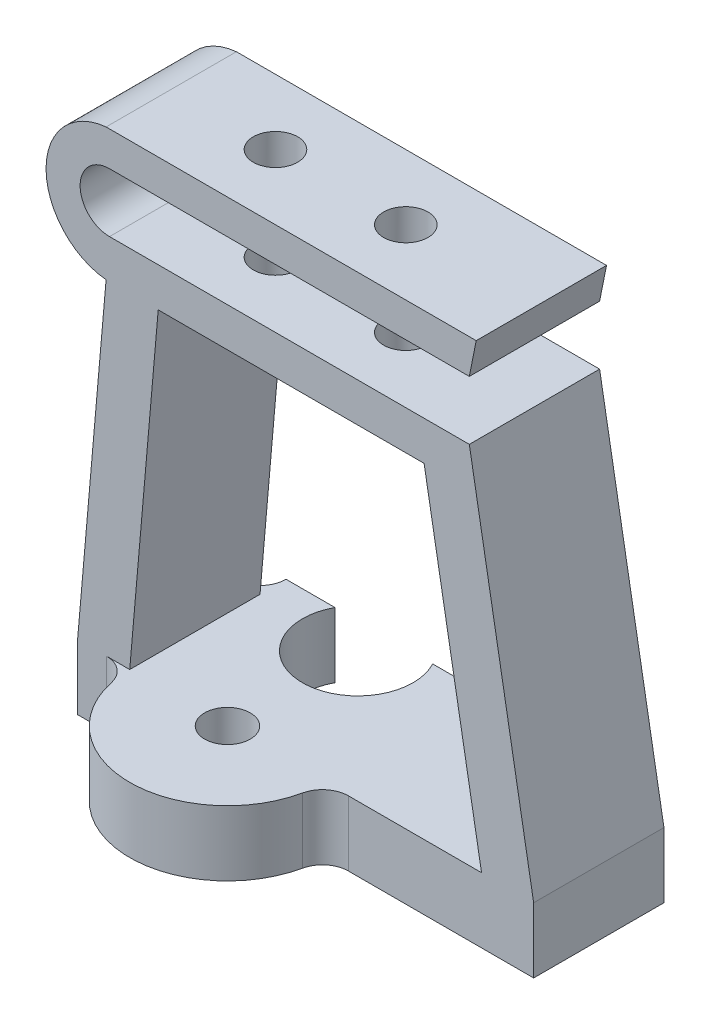
ISO-10303-21;
HEADER;
FILE_DESCRIPTION(('STEP AP214'),'2;1');
FILE_NAME('part.step','',(''),(''),'','','');
FILE_SCHEMA(('AUTOMOTIVE_DESIGN { 1 0 10303 214 1 1 1 1 }'));
ENDSEC;
DATA;
#1=APPLICATION_CONTEXT('core data for automotive mechanical design processes');
#2=APPLICATION_PROTOCOL_DEFINITION('international standard','automotive_design',2000,#1);
#3=PRODUCT_CONTEXT('',#1,'mechanical');
#4=PRODUCT('Part','Part','',(#3));
#5=PRODUCT_RELATED_PRODUCT_CATEGORY('part','',(#4));
#6=PRODUCT_DEFINITION_FORMATION('','',#4);
#7=PRODUCT_DEFINITION_CONTEXT('part definition',#1,'design');
#8=PRODUCT_DEFINITION('design','',#6,#7);
#9=PRODUCT_DEFINITION_SHAPE('','',#8);
#10=(LENGTH_UNIT() NAMED_UNIT(*) SI_UNIT(.MILLI.,.METRE.));
#11=(NAMED_UNIT(*) PLANE_ANGLE_UNIT() SI_UNIT($,.RADIAN.));
#12=(NAMED_UNIT(*) SI_UNIT($,.STERADIAN.) SOLID_ANGLE_UNIT());
#13=UNCERTAINTY_MEASURE_WITH_UNIT(LENGTH_MEASURE(1.E-05),#10,'distance_accuracy_value','');
#14=(GEOMETRIC_REPRESENTATION_CONTEXT(3) GLOBAL_UNCERTAINTY_ASSIGNED_CONTEXT((#13)) GLOBAL_UNIT_ASSIGNED_CONTEXT((#10,
#11,#12)) REPRESENTATION_CONTEXT('',''));
#15=CARTESIAN_POINT('',(0.,0.,0.));
#16=DIRECTION('',(0.,0.,1.));
#17=DIRECTION('',(1.,0.,0.));
#18=AXIS2_PLACEMENT_3D('',#15,#16,#17);
#19=CARTESIAN_POINT('',(0.,5.,10.));
#20=DIRECTION('',(0.,1.,0.));
#21=DIRECTION('',(0.,0.,1.));
#22=AXIS2_PLACEMENT_3D('',#19,#20,#21);
#23=PLANE('',#22);
#24=DIRECTION('',(1.,0.,0.));
#25=VECTOR('',#24,1.);
#26=CARTESIAN_POINT('',(-11.6253284417662,5.,-2.));
#27=LINE('',#26,#25);
#28=CARTESIAN_POINT('',(-7.5,5.,-2.));
#29=VERTEX_POINT('',#28);
#30=CARTESIAN_POINT('',(-3.75,5.,-2.));
#31=VERTEX_POINT('',#30);
#32=EDGE_CURVE('E216',#29,#31,#27,.T.);
#33=ORIENTED_EDGE('',*,*,#32,.F.);
#34=CARTESIAN_POINT('',(-9.5,5.,-2.));
#35=DIRECTION('',(0.,1.,0.));
#36=DIRECTION('',(0.,0.,1.));
#37=AXIS2_PLACEMENT_3D('',#34,#35,#36);
#38=CIRCLE('',#37,2.);
#39=CARTESIAN_POINT('',(-9.5,5.,0.));
#40=VERTEX_POINT('',#39);
#41=EDGE_CURVE('E230',#29,#40,#38,.F.);
#42=ORIENTED_EDGE('',*,*,#41,.T.);
#43=DIRECTION('',(-1.,0.,0.));
#44=VECTOR('',#43,1.);
#45=CARTESIAN_POINT('',(23.5,5.,0.));
#46=LINE('',#45,#44);
#47=CARTESIAN_POINT('',(-7.5,5.,0.));
#48=VERTEX_POINT('',#47);
#49=EDGE_CURVE('E62',#48,#40,#46,.T.);
#50=ORIENTED_EDGE('',*,*,#49,.F.);
#51=DIRECTION('',(0.,0.,1.));
#52=VECTOR('',#51,1.);
#53=CARTESIAN_POINT('',(-7.5,5.,-26.3760762570989));
#54=LINE('',#53,#52);
#55=CARTESIAN_POINT('',(-7.5,5.,10.));
#56=VERTEX_POINT('',#55);
#57=EDGE_CURVE('E405',#48,#56,#54,.T.);
#58=ORIENTED_EDGE('',*,*,#57,.T.);
#59=DIRECTION('',(1.,0.,0.));
#60=VECTOR('',#59,1.);
#61=CARTESIAN_POINT('',(23.5,5.,10.));
#62=LINE('',#61,#60);
#63=CARTESIAN_POINT('',(-9.28708781050335,5.,10.));
#64=VERTEX_POINT('',#63);
#65=EDGE_CURVE('E514',#64,#56,#62,.T.);
#66=ORIENTED_EDGE('',*,*,#65,.F.);
#67=CARTESIAN_POINT('',(-9.28708781050335,5.,12.));
#68=DIRECTION('',(0.,1.,0.));
#69=DIRECTION('',(0.,0.,1.));
#70=AXIS2_PLACEMENT_3D('',#67,#68,#69);
#71=CIRCLE('',#70,2.);
#72=CARTESIAN_POINT('',(-7.33191142934475,5.,11.5789473684211));
#73=VERTEX_POINT('',#72);
#74=EDGE_CURVE('E253',#64,#73,#71,.F.);
#75=ORIENTED_EDGE('',*,*,#74,.T.);
#76=CARTESIAN_POINT('',(0.,5.,10.));
#77=DIRECTION('',(0.,1.,0.));
#78=DIRECTION('',(0.,0.,1.));
#79=AXIS2_PLACEMENT_3D('',#76,#77,#78);
#80=CIRCLE('',#79,7.5);
#81=CARTESIAN_POINT('',(7.33191142934475,5.,11.5789473684211));
#82=VERTEX_POINT('',#81);
#83=EDGE_CURVE('E226',#73,#82,#80,.T.);
#84=ORIENTED_EDGE('',*,*,#83,.T.);
#85=CARTESIAN_POINT('',(9.28708781050335,5.,12.));
#86=DIRECTION('',(0.,1.,0.));
#87=DIRECTION('',(0.,0.,1.));
#88=AXIS2_PLACEMENT_3D('',#85,#86,#87);
#89=CIRCLE('',#88,2.);
#90=CARTESIAN_POINT('',(9.28708781050335,5.,10.));
#91=VERTEX_POINT('',#90);
#92=EDGE_CURVE('E259',#82,#91,#89,.F.);
#93=ORIENTED_EDGE('',*,*,#92,.T.);
#94=DIRECTION('',(-1.,0.,0.));
#95=VECTOR('',#94,1.);
#96=CARTESIAN_POINT('',(23.5,5.,10.));
#97=LINE('',#96,#95);
#98=CARTESIAN_POINT('',(19.5,5.,10.));
#99=VERTEX_POINT('',#98);
#100=EDGE_CURVE('E459',#99,#91,#97,.T.);
#101=ORIENTED_EDGE('',*,*,#100,.F.);
#102=DIRECTION('',(0.,0.,1.));
#103=VECTOR('',#102,1.);
#104=CARTESIAN_POINT('',(19.5,5.,-26.3760762570989));
#105=LINE('',#104,#103);
#106=CARTESIAN_POINT('',(19.5,5.,0.));
#107=VERTEX_POINT('',#106);
#108=EDGE_CURVE('E383',#107,#99,#105,.T.);
#109=ORIENTED_EDGE('',*,*,#108,.F.);
#110=DIRECTION('',(-1.,0.,0.));
#111=VECTOR('',#110,1.);
#112=CARTESIAN_POINT('',(23.5,5.,0.));
#113=LINE('',#112,#111);
#114=CARTESIAN_POINT('',(9.5,5.,0.));
#115=VERTEX_POINT('',#114);
#116=EDGE_CURVE('E463',#107,#115,#113,.T.);
#117=ORIENTED_EDGE('',*,*,#116,.T.);
#118=CARTESIAN_POINT('',(9.5,5.,-2.));
#119=DIRECTION('',(0.,1.,0.));
#120=DIRECTION('',(0.,0.,1.));
#121=AXIS2_PLACEMENT_3D('',#118,#119,#120);
#122=CIRCLE('',#121,2.);
#123=CARTESIAN_POINT('',(7.5,5.,-2.));
#124=VERTEX_POINT('',#123);
#125=EDGE_CURVE('E54',#115,#124,#122,.F.);
#126=ORIENTED_EDGE('',*,*,#125,.T.);
#127=CARTESIAN_POINT('',(3.75,5.,-2.));
#128=VERTEX_POINT('',#127);
#129=EDGE_CURVE('E70',#128,#124,#27,.T.);
#130=ORIENTED_EDGE('',*,*,#129,.F.);
#131=CARTESIAN_POINT('',(0.,5.,0.));
#132=DIRECTION('',(0.,1.,0.));
#133=DIRECTION('',(0.,0.,1.));
#134=AXIS2_PLACEMENT_3D('',#131,#132,#133);
#135=CIRCLE('',#134,4.25);
#136=EDGE_CURVE('E232',#31,#128,#135,.T.);
#137=ORIENTED_EDGE('',*,*,#136,.F.);
#138=EDGE_LOOP('',(#33,#42,#50,#58,#66,#75,#84,#93,#101,#109,#117,#126,#130,#137));
#139=FACE_BOUND('',#138,.T.);
#140=CARTESIAN_POINT('',(0.,5.,10.));
#141=DIRECTION('',(0.,1.,0.));
#142=DIRECTION('',(0.,0.,-1.));
#143=AXIS2_PLACEMENT_3D('',#140,#141,#142);
#144=CIRCLE('',#143,1.75);
#145=CARTESIAN_POINT('',(0.,5.,8.25));
#146=VERTEX_POINT('',#145);
#147=EDGE_CURVE('E476',#146,#146,#144,.T.);
#148=ORIENTED_EDGE('',*,*,#147,.F.);
#149=EDGE_LOOP('',(#148));
#150=FACE_BOUND('',#149,.T.);
#151=ADVANCED_FACE('F44',(#139,#150),#23,.T.);
#152=CARTESIAN_POINT('',(0.,0.,10.));
#153=DIRECTION('',(0.,1.,0.));
#154=DIRECTION('',(0.,0.,1.));
#155=AXIS2_PLACEMENT_3D('',#152,#153,#154);
#156=PLANE('',#155);
#157=CARTESIAN_POINT('',(-9.5,0.,-2.));
#158=DIRECTION('',(0.,1.,0.));
#159=DIRECTION('',(0.,0.,1.));
#160=AXIS2_PLACEMENT_3D('',#157,#158,#159);
#161=CIRCLE('',#160,2.);
#162=CARTESIAN_POINT('',(-9.5,0.,0.));
#163=VERTEX_POINT('',#162);
#164=CARTESIAN_POINT('',(-7.5,0.,-2.));
#165=VERTEX_POINT('',#164);
#166=EDGE_CURVE('E240',#163,#165,#161,.T.);
#167=ORIENTED_EDGE('',*,*,#166,.T.);
#168=DIRECTION('',(1.,0.,0.));
#169=VECTOR('',#168,1.);
#170=CARTESIAN_POINT('',(-11.6253284417662,0.,-2.));
#171=LINE('',#170,#169);
#172=CARTESIAN_POINT('',(-3.75,0.,-2.));
#173=VERTEX_POINT('',#172);
#174=EDGE_CURVE('E219',#165,#173,#171,.T.);
#175=ORIENTED_EDGE('',*,*,#174,.T.);
#176=CARTESIAN_POINT('',(0.,0.,0.));
#177=DIRECTION('',(0.,1.,0.));
#178=DIRECTION('',(0.,0.,1.));
#179=AXIS2_PLACEMENT_3D('',#176,#177,#178);
#180=CIRCLE('',#179,4.25);
#181=CARTESIAN_POINT('',(3.75,0.,-2.));
#182=VERTEX_POINT('',#181);
#183=EDGE_CURVE('E480',#173,#182,#180,.T.);
#184=ORIENTED_EDGE('',*,*,#183,.T.);
#185=CARTESIAN_POINT('',(7.5,0.,-2.));
#186=VERTEX_POINT('',#185);
#187=EDGE_CURVE('E234',#182,#186,#171,.T.);
#188=ORIENTED_EDGE('',*,*,#187,.T.);
#189=CARTESIAN_POINT('',(9.5,0.,-2.));
#190=DIRECTION('',(0.,1.,0.));
#191=DIRECTION('',(0.,0.,1.));
#192=AXIS2_PLACEMENT_3D('',#189,#190,#191);
#193=CIRCLE('',#192,2.);
#194=CARTESIAN_POINT('',(9.5,0.,0.));
#195=VERTEX_POINT('',#194);
#196=EDGE_CURVE('E11',#186,#195,#193,.T.);
#197=ORIENTED_EDGE('',*,*,#196,.T.);
#198=DIRECTION('',(-1.,0.,0.));
#199=VECTOR('',#198,1.);
#200=CARTESIAN_POINT('',(23.5,0.,0.));
#201=LINE('',#200,#199);
#202=CARTESIAN_POINT('',(23.5,0.,0.));
#203=VERTEX_POINT('',#202);
#204=EDGE_CURVE('E467',#203,#195,#201,.T.);
#205=ORIENTED_EDGE('',*,*,#204,.F.);
#206=DIRECTION('',(0.,0.,-1.));
#207=VECTOR('',#206,1.);
#208=CARTESIAN_POINT('',(23.5,0.,10.));
#209=LINE('',#208,#207);
#210=CARTESIAN_POINT('',(23.5,0.,10.));
#211=VERTEX_POINT('',#210);
#212=EDGE_CURVE('E448',#211,#203,#209,.T.);
#213=ORIENTED_EDGE('',*,*,#212,.F.);
#214=DIRECTION('',(-1.,0.,0.));
#215=VECTOR('',#214,1.);
#216=CARTESIAN_POINT('',(23.5,0.,10.));
#217=LINE('',#216,#215);
#218=CARTESIAN_POINT('',(9.28708781050335,0.,10.));
#219=VERTEX_POINT('',#218);
#220=EDGE_CURVE('E471',#211,#219,#217,.T.);
#221=ORIENTED_EDGE('',*,*,#220,.T.);
#222=CARTESIAN_POINT('',(9.28708781050335,0.,12.));
#223=DIRECTION('',(0.,1.,0.));
#224=DIRECTION('',(0.,0.,1.));
#225=AXIS2_PLACEMENT_3D('',#222,#223,#224);
#226=CIRCLE('',#225,2.);
#227=CARTESIAN_POINT('',(7.33191142934475,0.,11.5789473684211));
#228=VERTEX_POINT('',#227);
#229=EDGE_CURVE('E256',#219,#228,#226,.T.);
#230=ORIENTED_EDGE('',*,*,#229,.T.);
#231=CARTESIAN_POINT('',(0.,0.,10.));
#232=DIRECTION('',(0.,1.,0.));
#233=DIRECTION('',(0.,0.,1.));
#234=AXIS2_PLACEMENT_3D('',#231,#232,#233);
#235=CIRCLE('',#234,7.5);
#236=CARTESIAN_POINT('',(-7.33191142934475,0.,11.5789473684211));
#237=VERTEX_POINT('',#236);
#238=EDGE_CURVE('E486',#237,#228,#235,.T.);
#239=ORIENTED_EDGE('',*,*,#238,.F.);
#240=CARTESIAN_POINT('',(-9.28708781050335,0.,12.));
#241=DIRECTION('',(0.,1.,0.));
#242=DIRECTION('',(0.,0.,1.));
#243=AXIS2_PLACEMENT_3D('',#240,#241,#242);
#244=CIRCLE('',#243,2.);
#245=CARTESIAN_POINT('',(-9.28708781050335,0.,10.));
#246=VERTEX_POINT('',#245);
#247=EDGE_CURVE('E245',#237,#246,#244,.T.);
#248=ORIENTED_EDGE('',*,*,#247,.T.);
#249=DIRECTION('',(1.,0.,0.));
#250=VECTOR('',#249,1.);
#251=CARTESIAN_POINT('',(-11.5,0.,10.));
#252=LINE('',#251,#250);
#253=CARTESIAN_POINT('',(-11.5,0.,10.));
#254=VERTEX_POINT('',#253);
#255=EDGE_CURVE('E436',#254,#246,#252,.T.);
#256=ORIENTED_EDGE('',*,*,#255,.F.);
#257=DIRECTION('',(0.,0.,-1.));
#258=VECTOR('',#257,1.);
#259=CARTESIAN_POINT('',(-11.5,0.,10.));
#260=LINE('',#259,#258);
#261=CARTESIAN_POINT('',(-11.5,0.,0.));
#262=VERTEX_POINT('',#261);
#263=EDGE_CURVE('E428',#254,#262,#260,.T.);
#264=ORIENTED_EDGE('',*,*,#263,.T.);
#265=DIRECTION('',(1.,0.,0.));
#266=VECTOR('',#265,1.);
#267=CARTESIAN_POINT('',(-11.5,0.,0.));
#268=LINE('',#267,#266);
#269=EDGE_CURVE('E437',#262,#163,#268,.T.);
#270=ORIENTED_EDGE('',*,*,#269,.T.);
#271=EDGE_LOOP('',(#167,#175,#184,#188,#197,#205,#213,#221,#230,#239,#248,#256,#264,#270));
#272=FACE_BOUND('',#271,.T.);
#273=CARTESIAN_POINT('',(0.,0.,10.));
#274=DIRECTION('',(0.,1.,0.));
#275=DIRECTION('',(0.,0.,-1.));
#276=AXIS2_PLACEMENT_3D('',#273,#274,#275);
#277=CIRCLE('',#276,1.75);
#278=CARTESIAN_POINT('',(0.,0.,8.25));
#279=VERTEX_POINT('',#278);
#280=EDGE_CURVE('E475',#279,#279,#277,.T.);
#281=ORIENTED_EDGE('',*,*,#280,.T.);
#282=EDGE_LOOP('',(#281));
#283=FACE_BOUND('',#282,.T.);
#284=ADVANCED_FACE('F565',(#272,#283),#156,.F.);
#285=CARTESIAN_POINT('',(0.,5.,10.));
#286=DIRECTION('',(0.,-1.,0.));
#287=DIRECTION('',(0.,0.,-1.));
#288=AXIS2_PLACEMENT_3D('',#285,#286,#287);
#289=CYLINDRICAL_SURFACE('',#288,7.5);
#290=ORIENTED_EDGE('',*,*,#83,.F.);
#291=DIRECTION('',(0.,-1.,0.));
#292=VECTOR('',#291,1.);
#293=CARTESIAN_POINT('',(-7.33191142934476,5.,11.5789473684211));
#294=LINE('',#293,#292);
#295=EDGE_CURVE('E506',#73,#237,#294,.T.);
#296=ORIENTED_EDGE('',*,*,#295,.T.);
#297=ORIENTED_EDGE('',*,*,#238,.T.);
#298=DIRECTION('',(0.,-1.,0.));
#299=VECTOR('',#298,1.);
#300=CARTESIAN_POINT('',(7.33191142934476,5.,11.5789473684211));
#301=LINE('',#300,#299);
#302=EDGE_CURVE('E503',#228,#82,#301,.F.);
#303=ORIENTED_EDGE('',*,*,#302,.T.);
#304=EDGE_LOOP('',(#290,#296,#297,#303));
#305=FACE_BOUND('',#304,.T.);
#306=ADVANCED_FACE('F529',(#305),#289,.T.);
#307=CARTESIAN_POINT('',(0.,5.,0.));
#308=DIRECTION('',(0.,-1.,0.));
#309=DIRECTION('',(0.,0.,-1.));
#310=AXIS2_PLACEMENT_3D('',#307,#308,#309);
#311=CYLINDRICAL_SURFACE('',#310,4.25);
#312=DIRECTION('',(0.,-1.,0.));
#313=VECTOR('',#312,1.);
#314=CARTESIAN_POINT('',(-3.75,5.,-2.));
#315=LINE('',#314,#313);
#316=EDGE_CURVE('E302',#31,#173,#315,.T.);
#317=ORIENTED_EDGE('',*,*,#316,.F.);
#318=ORIENTED_EDGE('',*,*,#136,.T.);
#319=DIRECTION('',(0.,-1.,0.));
#320=VECTOR('',#319,1.);
#321=CARTESIAN_POINT('',(3.75,5.,-2.));
#322=LINE('',#321,#320);
#323=EDGE_CURVE('E299',#182,#128,#322,.F.);
#324=ORIENTED_EDGE('',*,*,#323,.F.);
#325=ORIENTED_EDGE('',*,*,#183,.F.);
#326=EDGE_LOOP('',(#317,#318,#324,#325));
#327=FACE_BOUND('',#326,.T.);
#328=ADVANCED_FACE('F574',(#327),#311,.F.);
#329=CARTESIAN_POINT('',(0.,5.,10.));
#330=DIRECTION('',(0.,-1.,0.));
#331=DIRECTION('',(0.,0.,-1.));
#332=AXIS2_PLACEMENT_3D('',#329,#330,#331);
#333=CYLINDRICAL_SURFACE('',#332,1.75);
#334=ORIENTED_EDGE('',*,*,#147,.T.);
#335=EDGE_LOOP('',(#334));
#336=FACE_BOUND('',#335,.T.);
#337=ORIENTED_EDGE('',*,*,#280,.F.);
#338=EDGE_LOOP('',(#337));
#339=FACE_BOUND('',#338,.T.);
#340=ADVANCED_FACE('F641',(#336,#339),#333,.F.);
#341=CARTESIAN_POINT('',(23.5,5.,10.));
#342=DIRECTION('',(0.,0.,-1.));
#343=DIRECTION('',(-1.,0.,0.));
#344=AXIS2_PLACEMENT_3D('',#341,#342,#343);
#345=PLANE('',#344);
#346=ORIENTED_EDGE('',*,*,#255,.T.);
#347=DIRECTION('',(0.,1.,0.));
#348=VECTOR('',#347,1.);
#349=CARTESIAN_POINT('',(-9.28708781050335,5.,10.));
#350=LINE('',#349,#348);
#351=EDGE_CURVE('E247',#246,#64,#350,.T.);
#352=ORIENTED_EDGE('',*,*,#351,.T.);
#353=ORIENTED_EDGE('',*,*,#65,.T.);
#354=DIRECTION('',(0.0871557427476543,0.996194698091746,0.));
#355=VECTOR('',#354,1.);
#356=CARTESIAN_POINT('',(-7.87714951796309,0.689161283720437,10.));
#357=LINE('',#356,#355);
#358=CARTESIAN_POINT('',(-5.312783411852,30.,10.));
#359=VERTEX_POINT('',#358);
#360=EDGE_CURVE('E396',#56,#359,#357,.T.);
#361=ORIENTED_EDGE('',*,*,#360,.T.);
#362=DIRECTION('',(1.,0.,0.));
#363=VECTOR('',#362,1.);
#364=CARTESIAN_POINT('',(19.0918254822883,30.,10.));
#365=LINE('',#364,#363);
#366=CARTESIAN_POINT('',(15.0918254822883,30.,10.));
#367=VERTEX_POINT('',#366);
#368=EDGE_CURVE('E350',#359,#367,#365,.T.);
#369=ORIENTED_EDGE('',*,*,#368,.T.);
#370=DIRECTION('',(-0.173648177666934,0.984807753012208,0.));
#371=VECTOR('',#370,1.);
#372=CARTESIAN_POINT('',(19.7670534109768,3.48546484546057,10.));
#373=LINE('',#372,#371);
#374=EDGE_CURVE('E380',#99,#367,#373,.T.);
#375=ORIENTED_EDGE('',*,*,#374,.F.);
#376=ORIENTED_EDGE('',*,*,#100,.T.);
#377=DIRECTION('',(0.,1.,0.));
#378=VECTOR('',#377,1.);
#379=CARTESIAN_POINT('',(9.28708781050335,0.,10.));
#380=LINE('',#379,#378);
#381=EDGE_CURVE('E510',#91,#219,#380,.F.);
#382=ORIENTED_EDGE('',*,*,#381,.T.);
#383=ORIENTED_EDGE('',*,*,#220,.F.);
#384=DIRECTION('',(0.,-1.,0.));
#385=VECTOR('',#384,1.);
#386=CARTESIAN_POINT('',(23.5,5.,10.));
#387=LINE('',#386,#385);
#388=CARTESIAN_POINT('',(23.5,5.,10.));
#389=VERTEX_POINT('',#388);
#390=EDGE_CURVE('E441',#389,#211,#387,.T.);
#391=ORIENTED_EDGE('',*,*,#390,.F.);
#392=DIRECTION('',(-0.173648177666934,0.984807753012208,0.));
#393=VECTOR('',#392,1.);
#394=CARTESIAN_POINT('',(23.6464386525486,4.16950513211192,10.));
#395=LINE('',#394,#393);
#396=CARTESIAN_POINT('',(18.5628445401629,33.,10.));
#397=VERTEX_POINT('',#396);
#398=EDGE_CURVE('E376',#389,#397,#395,.T.);
#399=ORIENTED_EDGE('',*,*,#398,.T.);
#400=DIRECTION('',(-1.,0.,0.));
#401=VECTOR('',#400,1.);
#402=CARTESIAN_POINT('',(18.5628445401629,33.,10.));
#403=LINE('',#402,#401);
#404=CARTESIAN_POINT('',(-9.05031742127424,33.,10.));
#405=VERTEX_POINT('',#404);
#406=EDGE_CURVE('E305',#397,#405,#403,.T.);
#407=ORIENTED_EDGE('',*,*,#406,.T.);
#408=CARTESIAN_POINT('',(-9.05031742127424,35.2567219166804,10.));
#409=DIRECTION('',(0.,0.,-1.));
#410=DIRECTION('',(1.,0.,0.));
#411=AXIS2_PLACEMENT_3D('',#408,#409,#410);
#412=CIRCLE('',#411,2.25672191668045);
#413=CARTESIAN_POINT('',(-9.05031742127424,37.5134438333609,10.));
#414=VERTEX_POINT('',#413);
#415=EDGE_CURVE('E330',#405,#414,#412,.T.);
#416=ORIENTED_EDGE('',*,*,#415,.T.);
#417=DIRECTION('',(1.,0.,0.));
#418=VECTOR('',#417,1.);
#419=CARTESIAN_POINT('',(-9.05031742127424,37.5134438333609,10.));
#420=LINE('',#419,#418);
#421=CARTESIAN_POINT('',(18.5628445401629,37.5134438333609,10.));
#422=VERTEX_POINT('',#421);
#423=EDGE_CURVE('E334',#414,#422,#420,.T.);
#424=ORIENTED_EDGE('',*,*,#423,.T.);
#425=DIRECTION('',(0.196172401242986,0.980569420791083,0.));
#426=VECTOR('',#425,1.);
#427=CARTESIAN_POINT('',(19.0918254822883,40.1575595843169,10.));
#428=LINE('',#427,#426);
#429=CARTESIAN_POINT('',(19.0918254822883,40.1575595843169,10.));
#430=VERTEX_POINT('',#429);
#431=EDGE_CURVE('E338',#422,#430,#428,.T.);
#432=ORIENTED_EDGE('',*,*,#431,.T.);
#433=DIRECTION('',(-1.,0.,0.));
#434=VECTOR('',#433,1.);
#435=CARTESIAN_POINT('',(-9.312783411852,40.1575595843169,10.));
#436=LINE('',#435,#434);
#437=CARTESIAN_POINT('',(-9.312783411852,40.1575595843169,10.));
#438=VERTEX_POINT('',#437);
#439=EDGE_CURVE('E342',#430,#438,#436,.T.);
#440=ORIENTED_EDGE('',*,*,#439,.T.);
#441=CARTESIAN_POINT('',(-8.81825785104488,35.0787797921584,10.));
#442=DIRECTION('',(0.,0.,1.));
#443=DIRECTION('',(1.,0.,0.));
#444=AXIS2_PLACEMENT_3D('',#441,#442,#443);
#445=CIRCLE('',#444,5.10279920313629);
#446=CARTESIAN_POINT('',(-9.312783411852,30.,10.));
#447=VERTEX_POINT('',#446);
#448=EDGE_CURVE('E346',#438,#447,#445,.T.);
#449=ORIENTED_EDGE('',*,*,#448,.T.);
#450=DIRECTION('',(0.0871557427476543,0.996194698091746,0.));
#451=VECTOR('',#450,1.);
#452=CARTESIAN_POINT('',(-11.8467650239875,1.03645763905428,10.));
#453=LINE('',#452,#451);
#454=CARTESIAN_POINT('',(-11.5,5.,10.));
#455=VERTEX_POINT('',#454);
#456=EDGE_CURVE('E401',#455,#447,#453,.T.);
#457=ORIENTED_EDGE('',*,*,#456,.F.);
#458=DIRECTION('',(0.,-1.,0.));
#459=VECTOR('',#458,1.);
#460=CARTESIAN_POINT('',(-11.5,5.,10.));
#461=LINE('',#460,#459);
#462=EDGE_CURVE('E424',#455,#254,#461,.T.);
#463=ORIENTED_EDGE('',*,*,#462,.T.);
#464=EDGE_LOOP('',(#346,#352,#353,#361,#369,#375,#376,#382,#383,#391,#399,#407,#416,#424,#432,
#440,#449,#457,#463));
#465=FACE_BOUND('',#464,.T.);
#466=ADVANCED_FACE('F521',(#465),#345,.F.);
#467=CARTESIAN_POINT('',(23.5,5.,0.));
#468=DIRECTION('',(0.,0.,1.));
#469=DIRECTION('',(1.,0.,0.));
#470=AXIS2_PLACEMENT_3D('',#467,#468,#469);
#471=PLANE('',#470);
#472=DIRECTION('',(0.0871557427476543,0.996194698091746,0.));
#473=VECTOR('',#472,1.);
#474=CARTESIAN_POINT('',(-7.87714951796309,0.689161283720437,0.));
#475=LINE('',#474,#473);
#476=CARTESIAN_POINT('',(-5.312783411852,30.,0.));
#477=VERTEX_POINT('',#476);
#478=EDGE_CURVE('E406',#48,#477,#475,.T.);
#479=ORIENTED_EDGE('',*,*,#478,.F.);
#480=ORIENTED_EDGE('',*,*,#49,.T.);
#481=DIRECTION('',(0.,1.,0.));
#482=VECTOR('',#481,1.);
#483=CARTESIAN_POINT('',(-9.5,0.,0.));
#484=LINE('',#483,#482);
#485=EDGE_CURVE('E238',#40,#163,#484,.F.);
#486=ORIENTED_EDGE('',*,*,#485,.T.);
#487=ORIENTED_EDGE('',*,*,#269,.F.);
#488=DIRECTION('',(0.,1.,0.));
#489=VECTOR('',#488,1.);
#490=CARTESIAN_POINT('',(-11.5,5.,0.));
#491=LINE('',#490,#489);
#492=CARTESIAN_POINT('',(-11.5,5.,0.));
#493=VERTEX_POINT('',#492);
#494=EDGE_CURVE('E432',#262,#493,#491,.T.);
#495=ORIENTED_EDGE('',*,*,#494,.T.);
#496=DIRECTION('',(0.0871557427476543,0.996194698091746,0.));
#497=VECTOR('',#496,1.);
#498=CARTESIAN_POINT('',(-11.8467650239875,1.03645763905428,0.));
#499=LINE('',#498,#497);
#500=CARTESIAN_POINT('',(-9.312783411852,30.,0.));
#501=VERTEX_POINT('',#500);
#502=EDGE_CURVE('E400',#493,#501,#499,.T.);
#503=ORIENTED_EDGE('',*,*,#502,.T.);
#504=CARTESIAN_POINT('',(-8.81825785104488,35.0787797921584,0.));
#505=DIRECTION('',(0.,0.,1.));
#506=DIRECTION('',(1.,0.,0.));
#507=AXIS2_PLACEMENT_3D('',#504,#505,#506);
#508=CIRCLE('',#507,5.10279920313629);
#509=CARTESIAN_POINT('',(-9.312783411852,40.1575595843169,0.));
#510=VERTEX_POINT('',#509);
#511=EDGE_CURVE('E319',#501,#510,#508,.F.);
#512=ORIENTED_EDGE('',*,*,#511,.T.);
#513=DIRECTION('',(1.,0.,0.));
#514=VECTOR('',#513,1.);
#515=CARTESIAN_POINT('',(-9.312783411852,40.1575595843169,0.));
#516=LINE('',#515,#514);
#517=CARTESIAN_POINT('',(19.0918254822883,40.1575595843169,0.));
#518=VERTEX_POINT('',#517);
#519=EDGE_CURVE('E316',#510,#518,#516,.T.);
#520=ORIENTED_EDGE('',*,*,#519,.T.);
#521=DIRECTION('',(-0.196172401242986,-0.980569420791084,0.));
#522=VECTOR('',#521,1.);
#523=CARTESIAN_POINT('',(19.0918254822883,40.1575595843169,0.));
#524=LINE('',#523,#522);
#525=CARTESIAN_POINT('',(18.5628445401629,37.5134438333609,0.));
#526=VERTEX_POINT('',#525);
#527=EDGE_CURVE('E313',#518,#526,#524,.T.);
#528=ORIENTED_EDGE('',*,*,#527,.T.);
#529=DIRECTION('',(-1.,0.,0.));
#530=VECTOR('',#529,1.);
#531=CARTESIAN_POINT('',(-9.05031742127424,37.5134438333609,0.));
#532=LINE('',#531,#530);
#533=CARTESIAN_POINT('',(-9.05031742127424,37.5134438333609,0.));
#534=VERTEX_POINT('',#533);
#535=EDGE_CURVE('E309',#526,#534,#532,.T.);
#536=ORIENTED_EDGE('',*,*,#535,.T.);
#537=CARTESIAN_POINT('',(-9.05031742127424,35.2567219166804,0.));
#538=DIRECTION('',(0.,0.,1.));
#539=DIRECTION('',(1.,0.,0.));
#540=AXIS2_PLACEMENT_3D('',#537,#538,#539);
#541=CIRCLE('',#540,2.25672191668045);
#542=CARTESIAN_POINT('',(-9.05031742127424,33.,0.));
#543=VERTEX_POINT('',#542);
#544=EDGE_CURVE('E306',#534,#543,#541,.T.);
#545=ORIENTED_EDGE('',*,*,#544,.T.);
#546=DIRECTION('',(1.,0.,0.));
#547=VECTOR('',#546,1.);
#548=CARTESIAN_POINT('',(18.5628445401629,33.,0.));
#549=LINE('',#548,#547);
#550=CARTESIAN_POINT('',(18.5628445401629,33.,0.));
#551=VERTEX_POINT('',#550);
#552=EDGE_CURVE('E326',#543,#551,#549,.T.);
#553=ORIENTED_EDGE('',*,*,#552,.T.);
#554=DIRECTION('',(-0.173648177666934,0.984807753012207,0.));
#555=VECTOR('',#554,1.);
#556=CARTESIAN_POINT('',(23.6464386525486,4.16950513211192,0.));
#557=LINE('',#556,#555);
#558=CARTESIAN_POINT('',(23.5,5.,0.));
#559=VERTEX_POINT('',#558);
#560=EDGE_CURVE('E384',#559,#551,#557,.T.);
#561=ORIENTED_EDGE('',*,*,#560,.F.);
#562=DIRECTION('',(0.,1.,0.));
#563=VECTOR('',#562,1.);
#564=CARTESIAN_POINT('',(23.5,5.,0.));
#565=LINE('',#564,#563);
#566=EDGE_CURVE('E451',#203,#559,#565,.T.);
#567=ORIENTED_EDGE('',*,*,#566,.F.);
#568=ORIENTED_EDGE('',*,*,#204,.T.);
#569=DIRECTION('',(0.,1.,0.));
#570=VECTOR('',#569,1.);
#571=CARTESIAN_POINT('',(9.5,5.,0.));
#572=LINE('',#571,#570);
#573=EDGE_CURVE('E225',#195,#115,#572,.T.);
#574=ORIENTED_EDGE('',*,*,#573,.T.);
#575=ORIENTED_EDGE('',*,*,#116,.F.);
#576=DIRECTION('',(-0.173648177666934,0.984807753012207,0.));
#577=VECTOR('',#576,1.);
#578=CARTESIAN_POINT('',(19.7670534109768,3.48546484546057,0.));
#579=LINE('',#578,#577);
#580=CARTESIAN_POINT('',(15.0918254822883,30.,0.));
#581=VERTEX_POINT('',#580);
#582=EDGE_CURVE('E379',#107,#581,#579,.T.);
#583=ORIENTED_EDGE('',*,*,#582,.T.);
#584=DIRECTION('',(-1.,0.,0.));
#585=VECTOR('',#584,1.);
#586=CARTESIAN_POINT('',(19.0918254822883,30.,0.));
#587=LINE('',#586,#585);
#588=EDGE_CURVE('E322',#581,#477,#587,.T.);
#589=ORIENTED_EDGE('',*,*,#588,.T.);
#590=EDGE_LOOP('',(#479,#480,#486,#487,#495,#503,#512,#520,#528,#536,#545,#553,#561,#567,#568,
#574,#575,#583,#589));
#591=FACE_BOUND('',#590,.T.);
#592=ADVANCED_FACE('F545',(#591),#471,.F.);
#593=CARTESIAN_POINT('',(23.5,0.,0.));
#594=DIRECTION('',(1.,0.,0.));
#595=DIRECTION('',(0.,0.,-1.));
#596=AXIS2_PLACEMENT_3D('',#593,#594,#595);
#597=PLANE('',#596);
#598=ORIENTED_EDGE('',*,*,#390,.T.);
#599=ORIENTED_EDGE('',*,*,#212,.T.);
#600=ORIENTED_EDGE('',*,*,#566,.T.);
#601=DIRECTION('',(0.,0.,1.));
#602=VECTOR('',#601,1.);
#603=CARTESIAN_POINT('',(23.5,5.,10.));
#604=LINE('',#603,#602);
#605=EDGE_CURVE('E455',#559,#389,#604,.T.);
#606=ORIENTED_EDGE('',*,*,#605,.T.);
#607=EDGE_LOOP('',(#598,#599,#600,#606));
#608=FACE_BOUND('',#607,.T.);
#609=ADVANCED_FACE('F561',(#608),#597,.T.);
#610=CARTESIAN_POINT('',(-11.5,0.,0.));
#611=DIRECTION('',(1.,0.,0.));
#612=DIRECTION('',(0.,0.,-1.));
#613=AXIS2_PLACEMENT_3D('',#610,#611,#612);
#614=PLANE('',#613);
#615=DIRECTION('',(0.,0.,1.));
#616=VECTOR('',#615,1.);
#617=CARTESIAN_POINT('',(-11.5,5.,10.));
#618=LINE('',#617,#616);
#619=EDGE_CURVE('E414',#493,#455,#618,.T.);
#620=ORIENTED_EDGE('',*,*,#619,.F.);
#621=ORIENTED_EDGE('',*,*,#494,.F.);
#622=ORIENTED_EDGE('',*,*,#263,.F.);
#623=ORIENTED_EDGE('',*,*,#462,.F.);
#624=EDGE_LOOP('',(#620,#621,#622,#623));
#625=FACE_BOUND('',#624,.T.);
#626=ADVANCED_FACE('F552',(#625),#614,.F.);
#627=CARTESIAN_POINT('',(-7.87714951796309,0.689161283720437,-26.3760762570989));
#628=DIRECTION('',(0.996194698091746,-0.0871557427476543,0.));
#629=DIRECTION('',(0.0871557427476543,0.996194698091746,0.));
#630=AXIS2_PLACEMENT_3D('',#627,#628,#629);
#631=PLANE('',#630);
#632=ORIENTED_EDGE('',*,*,#57,.F.);
#633=ORIENTED_EDGE('',*,*,#478,.T.);
#634=DIRECTION('',(0.,0.,1.));
#635=VECTOR('',#634,1.);
#636=CARTESIAN_POINT('',(-5.312783411852,30.,-26.3760762570989));
#637=LINE('',#636,#635);
#638=EDGE_CURVE('E410',#477,#359,#637,.T.);
#639=ORIENTED_EDGE('',*,*,#638,.T.);
#640=ORIENTED_EDGE('',*,*,#360,.F.);
#641=EDGE_LOOP('',(#632,#633,#639,#640));
#642=FACE_BOUND('',#641,.T.);
#643=ADVANCED_FACE('F549',(#642),#631,.T.);
#644=CARTESIAN_POINT('',(-11.8467650239875,1.03645763905428,-26.3760762570989));
#645=DIRECTION('',(0.996194698091746,-0.0871557427476542,0.));
#646=DIRECTION('',(0.0871557427476543,0.996194698091746,0.));
#647=AXIS2_PLACEMENT_3D('',#644,#645,#646);
#648=PLANE('',#647);
#649=ORIENTED_EDGE('',*,*,#502,.F.);
#650=ORIENTED_EDGE('',*,*,#619,.T.);
#651=ORIENTED_EDGE('',*,*,#456,.T.);
#652=DIRECTION('',(0.,0.,1.));
#653=VECTOR('',#652,1.);
#654=CARTESIAN_POINT('',(-9.312783411852,30.,-26.3760762570989));
#655=LINE('',#654,#653);
#656=EDGE_CURVE('E390',#501,#447,#655,.T.);
#657=ORIENTED_EDGE('',*,*,#656,.F.);
#658=EDGE_LOOP('',(#649,#650,#651,#657));
#659=FACE_BOUND('',#658,.T.);
#660=ADVANCED_FACE('F551',(#659),#648,.F.);
#661=CARTESIAN_POINT('',(23.6464386525486,4.16950513211192,-26.3760762570989));
#662=DIRECTION('',(0.984807753012207,0.173648177666934,0.));
#663=DIRECTION('',(-0.173648177666934,0.984807753012207,0.));
#664=AXIS2_PLACEMENT_3D('',#661,#662,#663);
#665=PLANE('',#664);
#666=ORIENTED_EDGE('',*,*,#605,.F.);
#667=ORIENTED_EDGE('',*,*,#560,.T.);
#668=DIRECTION('',(0.,0.,1.));
#669=VECTOR('',#668,1.);
#670=CARTESIAN_POINT('',(18.5628445401629,33.,-34.5402146790618));
#671=LINE('',#670,#669);
#672=EDGE_CURVE('E354',#551,#397,#671,.T.);
#673=ORIENTED_EDGE('',*,*,#672,.T.);
#674=ORIENTED_EDGE('',*,*,#398,.F.);
#675=EDGE_LOOP('',(#666,#667,#673,#674));
#676=FACE_BOUND('',#675,.T.);
#677=ADVANCED_FACE('F558',(#676),#665,.T.);
#678=CARTESIAN_POINT('',(19.7670534109768,3.48546484546057,-26.3760762570989));
#679=DIRECTION('',(0.984807753012207,0.173648177666934,0.));
#680=DIRECTION('',(-0.173648177666934,0.984807753012207,0.));
#681=AXIS2_PLACEMENT_3D('',#678,#679,#680);
#682=PLANE('',#681);
#683=ORIENTED_EDGE('',*,*,#582,.F.);
#684=ORIENTED_EDGE('',*,*,#108,.T.);
#685=ORIENTED_EDGE('',*,*,#374,.T.);
#686=DIRECTION('',(0.,0.,1.));
#687=VECTOR('',#686,1.);
#688=CARTESIAN_POINT('',(15.0918254822883,30.,-26.3760762570989));
#689=LINE('',#688,#687);
#690=EDGE_CURVE('E375',#581,#367,#689,.T.);
#691=ORIENTED_EDGE('',*,*,#690,.F.);
#692=EDGE_LOOP('',(#683,#684,#685,#691));
#693=FACE_BOUND('',#692,.T.);
#694=ADVANCED_FACE('F540',(#693),#682,.F.);
#695=CARTESIAN_POINT('',(19.0918254822883,30.,-34.5402146790618));
#696=DIRECTION('',(0.,-1.,0.));
#697=DIRECTION('',(0.,0.,-1.));
#698=AXIS2_PLACEMENT_3D('',#695,#696,#697);
#699=PLANE('',#698);
#700=CARTESIAN_POINT('',(-1.312783411852,30.,5.));
#701=DIRECTION('',(0.,-1.,0.));
#702=DIRECTION('',(0.,0.,-1.));
#703=AXIS2_PLACEMENT_3D('',#700,#701,#702);
#704=CIRCLE('',#703,1.7);
#705=CARTESIAN_POINT('',(-1.312783411852,30.,3.3));
#706=VERTEX_POINT('',#705);
#707=EDGE_CURVE('E267',#706,#706,#704,.F.);
#708=ORIENTED_EDGE('',*,*,#707,.T.);
#709=EDGE_LOOP('',(#708));
#710=FACE_BOUND('',#709,.T.);
#711=CARTESIAN_POINT('',(8.687216588148,30.,5.));
#712=DIRECTION('',(0.,-1.,0.));
#713=DIRECTION('',(0.,0.,-1.));
#714=AXIS2_PLACEMENT_3D('',#711,#712,#713);
#715=CIRCLE('',#714,1.7);
#716=CARTESIAN_POINT('',(8.687216588148,30.,3.3));
#717=VERTEX_POINT('',#716);
#718=EDGE_CURVE('E284',#717,#717,#715,.F.);
#719=ORIENTED_EDGE('',*,*,#718,.T.);
#720=EDGE_LOOP('',(#719));
#721=FACE_BOUND('',#720,.T.);
#722=ORIENTED_EDGE('',*,*,#638,.F.);
#723=ORIENTED_EDGE('',*,*,#588,.F.);
#724=ORIENTED_EDGE('',*,*,#690,.T.);
#725=ORIENTED_EDGE('',*,*,#368,.F.);
#726=EDGE_LOOP('',(#722,#723,#724,#725));
#727=FACE_BOUND('',#726,.T.);
#728=ADVANCED_FACE('F543',(#710,#721,#727),#699,.T.);
#729=CARTESIAN_POINT('',(-8.81825785104488,35.0787797921584,-34.5402146790618));
#730=DIRECTION('',(0.,0.,1.));
#731=DIRECTION('',(1.,0.,0.));
#732=AXIS2_PLACEMENT_3D('',#729,#730,#731);
#733=CYLINDRICAL_SURFACE('',#732,5.10279920313629);
#734=ORIENTED_EDGE('',*,*,#511,.F.);
#735=ORIENTED_EDGE('',*,*,#656,.T.);
#736=ORIENTED_EDGE('',*,*,#448,.F.);
#737=DIRECTION('',(0.,0.,1.));
#738=VECTOR('',#737,1.);
#739=CARTESIAN_POINT('',(-9.312783411852,40.1575595843169,-34.5402146790618));
#740=LINE('',#739,#738);
#741=EDGE_CURVE('E310',#510,#438,#740,.T.);
#742=ORIENTED_EDGE('',*,*,#741,.F.);
#743=EDGE_LOOP('',(#734,#735,#736,#742));
#744=FACE_BOUND('',#743,.T.);
#745=ADVANCED_FACE('F707',(#744),#733,.T.);
#746=CARTESIAN_POINT('',(-9.312783411852,40.1575595843169,-34.5402146790618));
#747=DIRECTION('',(0.,1.,0.));
#748=DIRECTION('',(0.,0.,1.));
#749=AXIS2_PLACEMENT_3D('',#746,#747,#748);
#750=PLANE('',#749);
#751=CARTESIAN_POINT('',(-1.312783411852,40.1575595843169,5.));
#752=DIRECTION('',(0.,1.,0.));
#753=DIRECTION('',(0.,0.,1.));
#754=AXIS2_PLACEMENT_3D('',#751,#752,#753);
#755=CIRCLE('',#754,1.7);
#756=CARTESIAN_POINT('',(-1.312783411852,40.1575595843169,6.7));
#757=VERTEX_POINT('',#756);
#758=EDGE_CURVE('E275',#757,#757,#755,.T.);
#759=ORIENTED_EDGE('',*,*,#758,.F.);
#760=EDGE_LOOP('',(#759));
#761=FACE_BOUND('',#760,.T.);
#762=CARTESIAN_POINT('',(8.687216588148,40.1575595843169,5.));
#763=DIRECTION('',(0.,1.,0.));
#764=DIRECTION('',(0.,0.,1.));
#765=AXIS2_PLACEMENT_3D('',#762,#763,#764);
#766=CIRCLE('',#765,1.7);
#767=CARTESIAN_POINT('',(8.687216588148,40.1575595843169,6.7));
#768=VERTEX_POINT('',#767);
#769=EDGE_CURVE('E281',#768,#768,#766,.T.);
#770=ORIENTED_EDGE('',*,*,#769,.F.);
#771=EDGE_LOOP('',(#770));
#772=FACE_BOUND('',#771,.T.);
#773=ORIENTED_EDGE('',*,*,#519,.F.);
#774=ORIENTED_EDGE('',*,*,#741,.T.);
#775=ORIENTED_EDGE('',*,*,#439,.F.);
#776=DIRECTION('',(0.,0.,1.));
#777=VECTOR('',#776,1.);
#778=CARTESIAN_POINT('',(19.0918254822883,40.1575595843169,-34.5402146790618));
#779=LINE('',#778,#777);
#780=EDGE_CURVE('E357',#518,#430,#779,.T.);
#781=ORIENTED_EDGE('',*,*,#780,.F.);
#782=EDGE_LOOP('',(#773,#774,#775,#781));
#783=FACE_BOUND('',#782,.T.);
#784=ADVANCED_FACE('F626',(#761,#772,#783),#750,.T.);
#785=CARTESIAN_POINT('',(19.0918254822883,40.1575595843169,-34.5402146790618));
#786=DIRECTION('',(0.980569420791083,-0.196172401242986,0.));
#787=DIRECTION('',(0.196172401242986,0.980569420791084,0.));
#788=AXIS2_PLACEMENT_3D('',#785,#786,#787);
#789=PLANE('',#788);
#790=ORIENTED_EDGE('',*,*,#527,.F.);
#791=ORIENTED_EDGE('',*,*,#780,.T.);
#792=ORIENTED_EDGE('',*,*,#431,.F.);
#793=DIRECTION('',(0.,0.,1.));
#794=VECTOR('',#793,1.);
#795=CARTESIAN_POINT('',(18.5628445401629,37.5134438333609,-34.5402146790618));
#796=LINE('',#795,#794);
#797=EDGE_CURVE('E360',#526,#422,#796,.T.);
#798=ORIENTED_EDGE('',*,*,#797,.F.);
#799=EDGE_LOOP('',(#790,#791,#792,#798));
#800=FACE_BOUND('',#799,.T.);
#801=ADVANCED_FACE('F621',(#800),#789,.T.);
#802=CARTESIAN_POINT('',(-9.05031742127424,37.5134438333609,-34.5402146790618));
#803=DIRECTION('',(0.,-1.,0.));
#804=DIRECTION('',(0.,0.,-1.));
#805=AXIS2_PLACEMENT_3D('',#802,#803,#804);
#806=PLANE('',#805);
#807=CARTESIAN_POINT('',(-1.312783411852,37.5134438333609,5.));
#808=DIRECTION('',(0.,-1.,0.));
#809=DIRECTION('',(0.,0.,-1.));
#810=AXIS2_PLACEMENT_3D('',#807,#808,#809);
#811=CIRCLE('',#810,1.7);
#812=CARTESIAN_POINT('',(-1.312783411852,37.5134438333609,3.3));
#813=VERTEX_POINT('',#812);
#814=EDGE_CURVE('E291',#813,#813,#811,.T.);
#815=ORIENTED_EDGE('',*,*,#814,.F.);
#816=EDGE_LOOP('',(#815));
#817=FACE_BOUND('',#816,.T.);
#818=CARTESIAN_POINT('',(8.687216588148,37.5134438333609,5.));
#819=DIRECTION('',(0.,-1.,0.));
#820=DIRECTION('',(0.,0.,-1.));
#821=AXIS2_PLACEMENT_3D('',#818,#819,#820);
#822=CIRCLE('',#821,1.7);
#823=CARTESIAN_POINT('',(8.687216588148,37.5134438333609,3.3));
#824=VERTEX_POINT('',#823);
#825=EDGE_CURVE('E266',#824,#824,#822,.T.);
#826=ORIENTED_EDGE('',*,*,#825,.F.);
#827=EDGE_LOOP('',(#826));
#828=FACE_BOUND('',#827,.T.);
#829=ORIENTED_EDGE('',*,*,#535,.F.);
#830=ORIENTED_EDGE('',*,*,#797,.T.);
#831=ORIENTED_EDGE('',*,*,#423,.F.);
#832=DIRECTION('',(0.,0.,1.));
#833=VECTOR('',#832,1.);
#834=CARTESIAN_POINT('',(-9.05031742127424,37.5134438333609,-34.5402146790618));
#835=LINE('',#834,#833);
#836=EDGE_CURVE('E363',#534,#414,#835,.T.);
#837=ORIENTED_EDGE('',*,*,#836,.F.);
#838=EDGE_LOOP('',(#829,#830,#831,#837));
#839=FACE_BOUND('',#838,.T.);
#840=ADVANCED_FACE('F617',(#817,#828,#839),#806,.T.);
#841=CARTESIAN_POINT('',(-9.05031742127424,35.2567219166804,-34.5402146790618));
#842=DIRECTION('',(0.,0.,1.));
#843=DIRECTION('',(1.,0.,0.));
#844=AXIS2_PLACEMENT_3D('',#841,#842,#843);
#845=CYLINDRICAL_SURFACE('',#844,2.25672191668045);
#846=ORIENTED_EDGE('',*,*,#544,.F.);
#847=ORIENTED_EDGE('',*,*,#836,.T.);
#848=ORIENTED_EDGE('',*,*,#415,.F.);
#849=DIRECTION('',(0.,0.,1.));
#850=VECTOR('',#849,1.);
#851=CARTESIAN_POINT('',(-9.05031742127424,33.,-34.5402146790618));
#852=LINE('',#851,#850);
#853=EDGE_CURVE('E366',#543,#405,#852,.T.);
#854=ORIENTED_EDGE('',*,*,#853,.F.);
#855=EDGE_LOOP('',(#846,#847,#848,#854));
#856=FACE_BOUND('',#855,.T.);
#857=ADVANCED_FACE('F611',(#856),#845,.F.);
#858=CARTESIAN_POINT('',(18.5628445401629,33.,-34.5402146790618));
#859=DIRECTION('',(0.,1.,0.));
#860=DIRECTION('',(-1.,0.,0.));
#861=AXIS2_PLACEMENT_3D('',#858,#859,#860);
#862=PLANE('',#861);
#863=CARTESIAN_POINT('',(-1.312783411852,33.,5.));
#864=DIRECTION('',(0.,1.,0.));
#865=DIRECTION('',(-1.,0.,0.));
#866=AXIS2_PLACEMENT_3D('',#863,#864,#865);
#867=CIRCLE('',#866,1.7);
#868=CARTESIAN_POINT('',(-3.012783411852,33.,5.));
#869=VERTEX_POINT('',#868);
#870=EDGE_CURVE('E48',#869,#869,#867,.T.);
#871=ORIENTED_EDGE('',*,*,#870,.F.);
#872=EDGE_LOOP('',(#871));
#873=FACE_BOUND('',#872,.T.);
#874=CARTESIAN_POINT('',(8.687216588148,33.,5.));
#875=DIRECTION('',(0.,1.,0.));
#876=DIRECTION('',(-1.,0.,0.));
#877=AXIS2_PLACEMENT_3D('',#874,#875,#876);
#878=CIRCLE('',#877,1.7);
#879=CARTESIAN_POINT('',(6.987216588148,33.,5.));
#880=VERTEX_POINT('',#879);
#881=EDGE_CURVE('E263',#880,#880,#878,.T.);
#882=ORIENTED_EDGE('',*,*,#881,.F.);
#883=EDGE_LOOP('',(#882));
#884=FACE_BOUND('',#883,.T.);
#885=ORIENTED_EDGE('',*,*,#552,.F.);
#886=ORIENTED_EDGE('',*,*,#853,.T.);
#887=ORIENTED_EDGE('',*,*,#406,.F.);
#888=ORIENTED_EDGE('',*,*,#672,.F.);
#889=EDGE_LOOP('',(#885,#886,#887,#888));
#890=FACE_BOUND('',#889,.T.);
#891=ADVANCED_FACE('F581',(#873,#884,#890),#862,.T.);
#892=CARTESIAN_POINT('',(-9.5,5.,-2.));
#893=DIRECTION('',(0.,-1.,0.));
#894=DIRECTION('',(0.,0.,-1.));
#895=AXIS2_PLACEMENT_3D('',#892,#893,#894);
#896=CYLINDRICAL_SURFACE('',#895,2.);
#897=ORIENTED_EDGE('',*,*,#166,.F.);
#898=ORIENTED_EDGE('',*,*,#485,.F.);
#899=ORIENTED_EDGE('',*,*,#41,.F.);
#900=DIRECTION('',(0.,1.,0.));
#901=VECTOR('',#900,1.);
#902=CARTESIAN_POINT('',(-7.5,5.,-2.));
#903=LINE('',#902,#901);
#904=EDGE_CURVE('E213',#165,#29,#903,.T.);
#905=ORIENTED_EDGE('',*,*,#904,.F.);
#906=EDGE_LOOP('',(#897,#898,#899,#905));
#907=FACE_BOUND('',#906,.T.);
#908=ADVANCED_FACE('F237',(#907),#896,.F.);
#909=CARTESIAN_POINT('',(-9.28708781050335,5.,12.));
#910=DIRECTION('',(0.,-1.,0.));
#911=DIRECTION('',(0.,0.,-1.));
#912=AXIS2_PLACEMENT_3D('',#909,#910,#911);
#913=CYLINDRICAL_SURFACE('',#912,2.);
#914=ORIENTED_EDGE('',*,*,#74,.F.);
#915=ORIENTED_EDGE('',*,*,#351,.F.);
#916=ORIENTED_EDGE('',*,*,#247,.F.);
#917=ORIENTED_EDGE('',*,*,#295,.F.);
#918=EDGE_LOOP('',(#914,#915,#916,#917));
#919=FACE_BOUND('',#918,.T.);
#920=ADVANCED_FACE('F525',(#919),#913,.F.);
#921=CARTESIAN_POINT('',(9.28708781050335,5.,12.));
#922=DIRECTION('',(0.,-1.,0.));
#923=DIRECTION('',(0.,0.,-1.));
#924=AXIS2_PLACEMENT_3D('',#921,#922,#923);
#925=CYLINDRICAL_SURFACE('',#924,2.);
#926=ORIENTED_EDGE('',*,*,#92,.F.);
#927=ORIENTED_EDGE('',*,*,#302,.F.);
#928=ORIENTED_EDGE('',*,*,#229,.F.);
#929=ORIENTED_EDGE('',*,*,#381,.F.);
#930=EDGE_LOOP('',(#926,#927,#928,#929));
#931=FACE_BOUND('',#930,.T.);
#932=ADVANCED_FACE('F533',(#931),#925,.F.);
#933=CARTESIAN_POINT('',(9.5,5.,-2.));
#934=DIRECTION('',(0.,-1.,0.));
#935=DIRECTION('',(0.,0.,-1.));
#936=AXIS2_PLACEMENT_3D('',#933,#934,#935);
#937=CYLINDRICAL_SURFACE('',#936,2.);
#938=ORIENTED_EDGE('',*,*,#196,.F.);
#939=DIRECTION('',(0.,1.,0.));
#940=VECTOR('',#939,1.);
#941=CARTESIAN_POINT('',(7.5,0.,-2.));
#942=LINE('',#941,#940);
#943=EDGE_CURVE('E241',#124,#186,#942,.F.);
#944=ORIENTED_EDGE('',*,*,#943,.F.);
#945=ORIENTED_EDGE('',*,*,#125,.F.);
#946=ORIENTED_EDGE('',*,*,#573,.F.);
#947=EDGE_LOOP('',(#938,#944,#945,#946));
#948=FACE_BOUND('',#947,.T.);
#949=ADVANCED_FACE('F46',(#948),#937,.F.);
#950=CARTESIAN_POINT('',(-11.6253284417662,0.,-2.));
#951=DIRECTION('',(0.,0.,1.));
#952=DIRECTION('',(1.,0.,0.));
#953=AXIS2_PLACEMENT_3D('',#950,#951,#952);
#954=PLANE('',#953);
#955=ORIENTED_EDGE('',*,*,#323,.T.);
#956=ORIENTED_EDGE('',*,*,#129,.T.);
#957=ORIENTED_EDGE('',*,*,#943,.T.);
#958=ORIENTED_EDGE('',*,*,#187,.F.);
#959=EDGE_LOOP('',(#955,#956,#957,#958));
#960=FACE_BOUND('',#959,.T.);
#961=ADVANCED_FACE('F587',(#960),#954,.F.);
#962=ORIENTED_EDGE('',*,*,#316,.T.);
#963=ORIENTED_EDGE('',*,*,#174,.F.);
#964=ORIENTED_EDGE('',*,*,#904,.T.);
#965=ORIENTED_EDGE('',*,*,#32,.T.);
#966=EDGE_LOOP('',(#962,#963,#964,#965));
#967=FACE_BOUND('',#966,.T.);
#968=ADVANCED_FACE('F215',(#967),#954,.F.);
#969=CARTESIAN_POINT('',(8.687216588148,25.1916738879315,5.));
#970=DIRECTION('',(0.,1.,0.));
#971=DIRECTION('',(0.,0.,1.));
#972=AXIS2_PLACEMENT_3D('',#969,#970,#971);
#973=CYLINDRICAL_SURFACE('',#972,1.7);
#974=ORIENTED_EDGE('',*,*,#881,.T.);
#975=EDGE_LOOP('',(#974));
#976=FACE_BOUND('',#975,.T.);
#977=ORIENTED_EDGE('',*,*,#718,.F.);
#978=EDGE_LOOP('',(#977));
#979=FACE_BOUND('',#978,.T.);
#980=ADVANCED_FACE('F893',(#976,#979),#973,.F.);
#981=CARTESIAN_POINT('',(-1.312783411852,25.1916738879315,5.));
#982=DIRECTION('',(0.,1.,0.));
#983=DIRECTION('',(0.,0.,1.));
#984=AXIS2_PLACEMENT_3D('',#981,#982,#983);
#985=CYLINDRICAL_SURFACE('',#984,1.7);
#986=ORIENTED_EDGE('',*,*,#870,.T.);
#987=EDGE_LOOP('',(#986));
#988=FACE_BOUND('',#987,.T.);
#989=ORIENTED_EDGE('',*,*,#707,.F.);
#990=EDGE_LOOP('',(#989));
#991=FACE_BOUND('',#990,.T.);
#992=ADVANCED_FACE('F901',(#988,#991),#985,.F.);
#993=ORIENTED_EDGE('',*,*,#825,.T.);
#994=EDGE_LOOP('',(#993));
#995=FACE_BOUND('',#994,.T.);
#996=ORIENTED_EDGE('',*,*,#769,.T.);
#997=EDGE_LOOP('',(#996));
#998=FACE_BOUND('',#997,.T.);
#999=ADVANCED_FACE('F903',(#995,#998),#973,.F.);
#1000=ORIENTED_EDGE('',*,*,#814,.T.);
#1001=EDGE_LOOP('',(#1000));
#1002=FACE_BOUND('',#1001,.T.);
#1003=ORIENTED_EDGE('',*,*,#758,.T.);
#1004=EDGE_LOOP('',(#1003));
#1005=FACE_BOUND('',#1004,.T.);
#1006=ADVANCED_FACE('F913',(#1002,#1005),#985,.F.);
#1007=CLOSED_SHELL('',(#151,#284,#306,#328,#340,#466,#592,#609,#626,#643,#660,#677,#694,#728,
#745,#784,#801,#840,#857,#891,#908,#920,#932,#949,#961,#968,#980,#992,#999,#1006));
#1008=MANIFOLD_SOLID_BREP('B2',#1007);
#1009=ADVANCED_BREP_SHAPE_REPRESENTATION('',(#18,#1008),#14);
#1010=SHAPE_DEFINITION_REPRESENTATION(#9,#1009);
ENDSEC;
END-ISO-10303-21;
